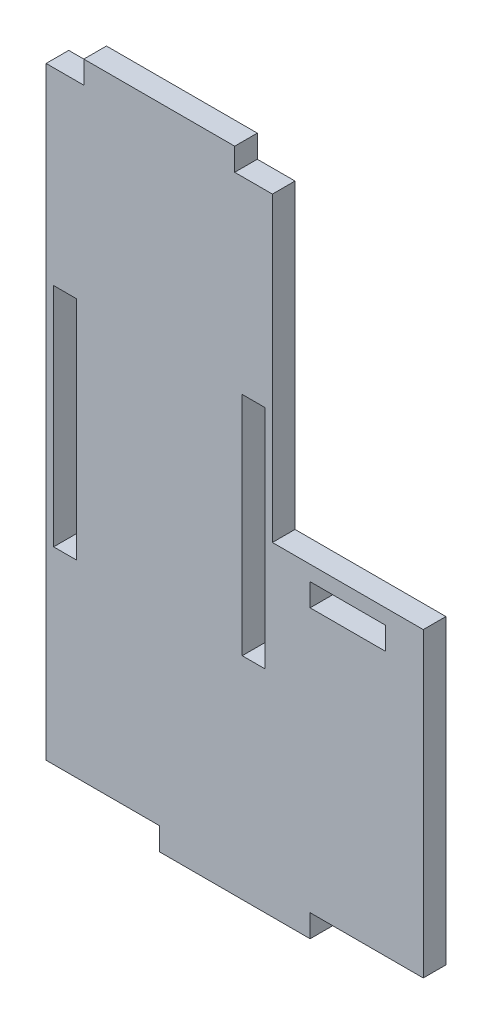
ISO-10303-21;
HEADER;
FILE_DESCRIPTION(('STEP AP214'),'2;1');
FILE_NAME('part.step','',(''),(''),'','','');
FILE_SCHEMA(('AUTOMOTIVE_DESIGN { 1 0 10303 214 1 1 1 1 }'));
ENDSEC;
DATA;
#1=APPLICATION_CONTEXT('core data for automotive mechanical design processes');
#2=APPLICATION_PROTOCOL_DEFINITION('international standard','automotive_design',2000,#1);
#3=PRODUCT_CONTEXT('',#1,'mechanical');
#4=PRODUCT('Part','Part','',(#3));
#5=PRODUCT_RELATED_PRODUCT_CATEGORY('part','',(#4));
#6=PRODUCT_DEFINITION_FORMATION('','',#4);
#7=PRODUCT_DEFINITION_CONTEXT('part definition',#1,'design');
#8=PRODUCT_DEFINITION('design','',#6,#7);
#9=PRODUCT_DEFINITION_SHAPE('','',#8);
#10=(LENGTH_UNIT() NAMED_UNIT(*) SI_UNIT(.MILLI.,.METRE.));
#11=(NAMED_UNIT(*) PLANE_ANGLE_UNIT() SI_UNIT($,.RADIAN.));
#12=(NAMED_UNIT(*) SI_UNIT($,.STERADIAN.) SOLID_ANGLE_UNIT());
#13=UNCERTAINTY_MEASURE_WITH_UNIT(LENGTH_MEASURE(1.E-05),#10,'distance_accuracy_value','');
#14=(GEOMETRIC_REPRESENTATION_CONTEXT(3) GLOBAL_UNCERTAINTY_ASSIGNED_CONTEXT((#13)) GLOBAL_UNIT_ASSIGNED_CONTEXT((#10,
#11,#12)) REPRESENTATION_CONTEXT('',''));
#15=CARTESIAN_POINT('',(0.,0.,0.));
#16=DIRECTION('',(0.,0.,1.));
#17=DIRECTION('',(1.,0.,0.));
#18=AXIS2_PLACEMENT_3D('',#15,#16,#17);
#19=CARTESIAN_POINT('',(0.,0.,1.5));
#20=DIRECTION('',(0.,0.,1.));
#21=DIRECTION('',(1.,0.,0.));
#22=AXIS2_PLACEMENT_3D('',#19,#20,#21);
#23=PLANE('',#22);
#24=DIRECTION('',(0.,-1.,0.));
#25=VECTOR('',#24,1.);
#26=CARTESIAN_POINT('',(-14.9999999999999,39.9999999999998,1.5));
#27=LINE('',#26,#25);
#28=CARTESIAN_POINT('',(-14.9999999999999,39.9999999999998,1.5));
#29=VERTEX_POINT('',#28);
#30=CARTESIAN_POINT('',(-14.9999999999999,-40.0000000000003,1.5));
#31=VERTEX_POINT('',#30);
#32=EDGE_CURVE('E303',#29,#31,#27,.T.);
#33=ORIENTED_EDGE('',*,*,#32,.T.);
#34=DIRECTION('',(1.,0.,0.));
#35=VECTOR('',#34,1.);
#36=CARTESIAN_POINT('',(-14.9999999999999,-40.0000000000003,1.5));
#37=LINE('',#36,#35);
#38=CARTESIAN_POINT('',(0.,-40.0000000000003,1.5));
#39=VERTEX_POINT('',#38);
#40=EDGE_CURVE('E306',#31,#39,#37,.T.);
#41=ORIENTED_EDGE('',*,*,#40,.T.);
#42=DIRECTION('',(0.,-1.,0.));
#43=VECTOR('',#42,1.);
#44=CARTESIAN_POINT('',(0.,-40.0000000000003,1.5));
#45=LINE('',#44,#43);
#46=CARTESIAN_POINT('',(0.,-43.0000000000003,1.5));
#47=VERTEX_POINT('',#46);
#48=EDGE_CURVE('E309',#39,#47,#45,.T.);
#49=ORIENTED_EDGE('',*,*,#48,.T.);
#50=DIRECTION('',(1.,0.,0.));
#51=VECTOR('',#50,1.);
#52=CARTESIAN_POINT('',(0.,-43.0000000000003,1.5));
#53=LINE('',#52,#51);
#54=CARTESIAN_POINT('',(20.0000000000001,-43.0000000000003,1.5));
#55=VERTEX_POINT('',#54);
#56=EDGE_CURVE('E311',#47,#55,#53,.T.);
#57=ORIENTED_EDGE('',*,*,#56,.T.);
#58=DIRECTION('',(0.,1.,0.));
#59=VECTOR('',#58,1.);
#60=CARTESIAN_POINT('',(20.0000000000001,-40.0000000000003,1.5));
#61=LINE('',#60,#59);
#62=CARTESIAN_POINT('',(20.0000000000001,-40.0000000000003,1.5));
#63=VERTEX_POINT('',#62);
#64=EDGE_CURVE('E313',#55,#63,#61,.T.);
#65=ORIENTED_EDGE('',*,*,#64,.T.);
#66=DIRECTION('',(1.,0.,0.));
#67=VECTOR('',#66,1.);
#68=CARTESIAN_POINT('',(20.0000000000001,-40.0000000000003,1.5));
#69=LINE('',#68,#67);
#70=CARTESIAN_POINT('',(35.0000000000001,-40.0000000000003,1.5));
#71=VERTEX_POINT('',#70);
#72=EDGE_CURVE('E315',#63,#71,#69,.T.);
#73=ORIENTED_EDGE('',*,*,#72,.T.);
#74=DIRECTION('',(0.,1.,0.));
#75=VECTOR('',#74,1.);
#76=CARTESIAN_POINT('',(35.0000000000001,-2.56739074444567E-13,1.5));
#77=LINE('',#76,#75);
#78=CARTESIAN_POINT('',(35.0000000000001,-2.56739074444567E-13,1.5));
#79=VERTEX_POINT('',#78);
#80=EDGE_CURVE('E317',#71,#79,#77,.T.);
#81=ORIENTED_EDGE('',*,*,#80,.T.);
#82=DIRECTION('',(-1.,0.,0.));
#83=VECTOR('',#82,1.);
#84=CARTESIAN_POINT('',(15.0000000000001,-2.22044604925031E-13,1.5));
#85=LINE('',#84,#83);
#86=CARTESIAN_POINT('',(15.0000000000001,-2.22044604925031E-13,1.5));
#87=VERTEX_POINT('',#86);
#88=EDGE_CURVE('E319',#79,#87,#85,.T.);
#89=ORIENTED_EDGE('',*,*,#88,.T.);
#90=DIRECTION('',(0.,1.,0.));
#91=VECTOR('',#90,1.);
#92=CARTESIAN_POINT('',(14.9999999999997,39.9999999999997,1.5));
#93=LINE('',#92,#91);
#94=CARTESIAN_POINT('',(14.9999999999997,39.9999999999997,1.5));
#95=VERTEX_POINT('',#94);
#96=EDGE_CURVE('E321',#87,#95,#93,.T.);
#97=ORIENTED_EDGE('',*,*,#96,.T.);
#98=DIRECTION('',(-1.,0.,0.));
#99=VECTOR('',#98,1.);
#100=CARTESIAN_POINT('',(10.0000000000001,39.9999999999997,1.5));
#101=LINE('',#100,#99);
#102=CARTESIAN_POINT('',(10.0000000000001,39.9999999999997,1.5));
#103=VERTEX_POINT('',#102);
#104=EDGE_CURVE('E323',#95,#103,#101,.T.);
#105=ORIENTED_EDGE('',*,*,#104,.T.);
#106=DIRECTION('',(0.,1.,0.));
#107=VECTOR('',#106,1.);
#108=CARTESIAN_POINT('',(10.0000000000001,39.9999999999997,1.5));
#109=LINE('',#108,#107);
#110=CARTESIAN_POINT('',(10.0000000000001,42.9999999999997,1.5));
#111=VERTEX_POINT('',#110);
#112=EDGE_CURVE('E325',#103,#111,#109,.T.);
#113=ORIENTED_EDGE('',*,*,#112,.T.);
#114=DIRECTION('',(-1.,0.,0.));
#115=VECTOR('',#114,1.);
#116=CARTESIAN_POINT('',(-9.99999999999993,42.9999999999997,1.5));
#117=LINE('',#116,#115);
#118=CARTESIAN_POINT('',(-9.99999999999993,42.9999999999997,1.5));
#119=VERTEX_POINT('',#118);
#120=EDGE_CURVE('E327',#111,#119,#117,.T.);
#121=ORIENTED_EDGE('',*,*,#120,.T.);
#122=DIRECTION('',(0.,-1.,0.));
#123=VECTOR('',#122,1.);
#124=CARTESIAN_POINT('',(-9.99999999999993,39.9999999999997,1.5));
#125=LINE('',#124,#123);
#126=CARTESIAN_POINT('',(-9.99999999999993,39.9999999999997,1.5));
#127=VERTEX_POINT('',#126);
#128=EDGE_CURVE('E329',#119,#127,#125,.T.);
#129=ORIENTED_EDGE('',*,*,#128,.T.);
#130=DIRECTION('',(-1.,0.,0.));
#131=VECTOR('',#130,1.);
#132=CARTESIAN_POINT('',(-14.9999999999999,39.9999999999998,1.5));
#133=LINE('',#132,#131);
#134=EDGE_CURVE('E331',#127,#29,#133,.T.);
#135=ORIENTED_EDGE('',*,*,#134,.T.);
#136=EDGE_LOOP('',(#33,#41,#49,#57,#65,#73,#81,#89,#97,#105,#113,#121,#129,#135));
#137=FACE_BOUND('',#136,.T.);
#138=DIRECTION('',(1.,0.,0.));
#139=VECTOR('',#138,1.);
#140=CARTESIAN_POINT('',(-13.9999999999999,-15.0000000000002,1.5));
#141=LINE('',#140,#139);
#142=CARTESIAN_POINT('',(-13.9999999999999,-15.0000000000002,1.5));
#143=VERTEX_POINT('',#142);
#144=CARTESIAN_POINT('',(-10.9999999999999,-15.0000000000002,1.5));
#145=VERTEX_POINT('',#144);
#146=EDGE_CURVE('E274',#143,#145,#141,.T.);
#147=ORIENTED_EDGE('',*,*,#146,.F.);
#148=DIRECTION('',(0.,-1.,0.));
#149=VECTOR('',#148,1.);
#150=CARTESIAN_POINT('',(-13.9999999999999,14.9999999999998,1.5));
#151=LINE('',#150,#149);
#152=CARTESIAN_POINT('',(-13.9999999999999,14.9999999999998,1.5));
#153=VERTEX_POINT('',#152);
#154=EDGE_CURVE('E272',#153,#143,#151,.T.);
#155=ORIENTED_EDGE('',*,*,#154,.F.);
#156=DIRECTION('',(-1.,0.,0.));
#157=VECTOR('',#156,1.);
#158=CARTESIAN_POINT('',(-13.9999999999999,14.9999999999998,1.5));
#159=LINE('',#158,#157);
#160=CARTESIAN_POINT('',(-10.9999999999999,14.9999999999998,1.5));
#161=VERTEX_POINT('',#160);
#162=EDGE_CURVE('E280',#161,#153,#159,.T.);
#163=ORIENTED_EDGE('',*,*,#162,.F.);
#164=DIRECTION('',(0.,1.,0.));
#165=VECTOR('',#164,1.);
#166=CARTESIAN_POINT('',(-10.9999999999999,14.9999999999998,1.5));
#167=LINE('',#166,#165);
#168=EDGE_CURVE('E277',#145,#161,#167,.T.);
#169=ORIENTED_EDGE('',*,*,#168,.F.);
#170=EDGE_LOOP('',(#147,#155,#163,#169));
#171=FACE_BOUND('',#170,.T.);
#172=DIRECTION('',(1.,0.,0.));
#173=VECTOR('',#172,1.);
#174=CARTESIAN_POINT('',(10.9999999999998,-15.0000000000002,1.5));
#175=LINE('',#174,#173);
#176=CARTESIAN_POINT('',(10.9999999999998,-15.0000000000002,1.5));
#177=VERTEX_POINT('',#176);
#178=CARTESIAN_POINT('',(13.9999999999998,-15.0000000000002,1.5));
#179=VERTEX_POINT('',#178);
#180=EDGE_CURVE('E243',#177,#179,#175,.T.);
#181=ORIENTED_EDGE('',*,*,#180,.F.);
#182=DIRECTION('',(0.,-1.,0.));
#183=VECTOR('',#182,1.);
#184=CARTESIAN_POINT('',(10.9999999999998,14.9999999999998,1.5));
#185=LINE('',#184,#183);
#186=CARTESIAN_POINT('',(10.9999999999998,14.9999999999998,1.5));
#187=VERTEX_POINT('',#186);
#188=EDGE_CURVE('E241',#187,#177,#185,.T.);
#189=ORIENTED_EDGE('',*,*,#188,.F.);
#190=DIRECTION('',(-1.,0.,0.));
#191=VECTOR('',#190,1.);
#192=CARTESIAN_POINT('',(10.9999999999998,14.9999999999998,1.5));
#193=LINE('',#192,#191);
#194=CARTESIAN_POINT('',(13.9999999999998,14.9999999999998,1.5));
#195=VERTEX_POINT('',#194);
#196=EDGE_CURVE('E249',#195,#187,#193,.T.);
#197=ORIENTED_EDGE('',*,*,#196,.F.);
#198=DIRECTION('',(0.,1.,0.));
#199=VECTOR('',#198,1.);
#200=CARTESIAN_POINT('',(13.9999999999998,14.9999999999998,1.5));
#201=LINE('',#200,#199);
#202=EDGE_CURVE('E246',#179,#195,#201,.T.);
#203=ORIENTED_EDGE('',*,*,#202,.F.);
#204=EDGE_LOOP('',(#181,#189,#197,#203));
#205=FACE_BOUND('',#204,.T.);
#206=DIRECTION('',(1.,0.,0.));
#207=VECTOR('',#206,1.);
#208=CARTESIAN_POINT('',(20.0000000000001,-5.00000000000025,1.5));
#209=LINE('',#208,#207);
#210=CARTESIAN_POINT('',(20.0000000000001,-5.00000000000025,1.5));
#211=VERTEX_POINT('',#210);
#212=CARTESIAN_POINT('',(30.0000000000001,-5.00000000000025,1.5));
#213=VERTEX_POINT('',#212);
#214=EDGE_CURVE('E213',#211,#213,#209,.T.);
#215=ORIENTED_EDGE('',*,*,#214,.F.);
#216=DIRECTION('',(0.,-1.,0.));
#217=VECTOR('',#216,1.);
#218=CARTESIAN_POINT('',(20.0000000000001,-2.00000000000025,1.5));
#219=LINE('',#218,#217);
#220=CARTESIAN_POINT('',(20.0000000000001,-2.00000000000025,1.5));
#221=VERTEX_POINT('',#220);
#222=EDGE_CURVE('E205',#221,#211,#219,.T.);
#223=ORIENTED_EDGE('',*,*,#222,.F.);
#224=DIRECTION('',(-1.,0.,0.));
#225=VECTOR('',#224,1.);
#226=CARTESIAN_POINT('',(20.0000000000001,-2.00000000000025,1.5));
#227=LINE('',#226,#225);
#228=CARTESIAN_POINT('',(30.0000000000001,-2.00000000000025,1.5));
#229=VERTEX_POINT('',#228);
#230=EDGE_CURVE('E227',#229,#221,#227,.T.);
#231=ORIENTED_EDGE('',*,*,#230,.F.);
#232=DIRECTION('',(0.,1.,0.));
#233=VECTOR('',#232,1.);
#234=CARTESIAN_POINT('',(30.0000000000001,-2.00000000000025,1.5));
#235=LINE('',#234,#233);
#236=EDGE_CURVE('E225',#213,#229,#235,.T.);
#237=ORIENTED_EDGE('',*,*,#236,.F.);
#238=EDGE_LOOP('',(#215,#223,#231,#237));
#239=FACE_BOUND('',#238,.T.);
#240=ADVANCED_FACE('F32',(#137,#171,#205,#239),#23,.T.);
#241=CARTESIAN_POINT('',(0.,0.,-1.5));
#242=DIRECTION('',(0.,0.,1.));
#243=DIRECTION('',(1.,0.,0.));
#244=AXIS2_PLACEMENT_3D('',#241,#242,#243);
#245=PLANE('',#244);
#246=DIRECTION('',(0.,-1.,0.));
#247=VECTOR('',#246,1.);
#248=CARTESIAN_POINT('',(10.9999999999998,14.9999999999998,-1.5));
#249=LINE('',#248,#247);
#250=CARTESIAN_POINT('',(10.9999999999998,14.9999999999998,-1.5));
#251=VERTEX_POINT('',#250);
#252=CARTESIAN_POINT('',(10.9999999999998,-15.0000000000002,-1.5));
#253=VERTEX_POINT('',#252);
#254=EDGE_CURVE('E221',#251,#253,#249,.T.);
#255=ORIENTED_EDGE('',*,*,#254,.T.);
#256=DIRECTION('',(1.,0.,0.));
#257=VECTOR('',#256,1.);
#258=CARTESIAN_POINT('',(10.9999999999998,-15.0000000000002,-1.5));
#259=LINE('',#258,#257);
#260=CARTESIAN_POINT('',(13.9999999999998,-15.0000000000002,-1.5));
#261=VERTEX_POINT('',#260);
#262=EDGE_CURVE('E254',#253,#261,#259,.T.);
#263=ORIENTED_EDGE('',*,*,#262,.T.);
#264=DIRECTION('',(0.,1.,0.));
#265=VECTOR('',#264,1.);
#266=CARTESIAN_POINT('',(13.9999999999998,14.9999999999998,-1.5));
#267=LINE('',#266,#265);
#268=CARTESIAN_POINT('',(13.9999999999998,14.9999999999998,-1.5));
#269=VERTEX_POINT('',#268);
#270=EDGE_CURVE('E257',#261,#269,#267,.T.);
#271=ORIENTED_EDGE('',*,*,#270,.T.);
#272=DIRECTION('',(-1.,0.,0.));
#273=VECTOR('',#272,1.);
#274=CARTESIAN_POINT('',(10.9999999999998,14.9999999999998,-1.5));
#275=LINE('',#274,#273);
#276=EDGE_CURVE('E244',#269,#251,#275,.T.);
#277=ORIENTED_EDGE('',*,*,#276,.T.);
#278=EDGE_LOOP('',(#255,#263,#271,#277));
#279=FACE_BOUND('',#278,.T.);
#280=DIRECTION('',(0.,-1.,0.));
#281=VECTOR('',#280,1.);
#282=CARTESIAN_POINT('',(-14.9999999999999,39.9999999999998,-1.5));
#283=LINE('',#282,#281);
#284=CARTESIAN_POINT('',(-14.9999999999999,39.9999999999998,-1.5));
#285=VERTEX_POINT('',#284);
#286=CARTESIAN_POINT('',(-14.9999999999999,-40.0000000000003,-1.5));
#287=VERTEX_POINT('',#286);
#288=EDGE_CURVE('E302',#285,#287,#283,.T.);
#289=ORIENTED_EDGE('',*,*,#288,.F.);
#290=DIRECTION('',(-1.,0.,0.));
#291=VECTOR('',#290,1.);
#292=CARTESIAN_POINT('',(-14.9999999999999,39.9999999999998,-1.5));
#293=LINE('',#292,#291);
#294=CARTESIAN_POINT('',(-9.99999999999993,39.9999999999997,-1.5));
#295=VERTEX_POINT('',#294);
#296=EDGE_CURVE('E307',#295,#285,#293,.T.);
#297=ORIENTED_EDGE('',*,*,#296,.F.);
#298=DIRECTION('',(0.,-1.,0.));
#299=VECTOR('',#298,1.);
#300=CARTESIAN_POINT('',(-9.99999999999993,39.9999999999997,-1.5));
#301=LINE('',#300,#299);
#302=CARTESIAN_POINT('',(-9.99999999999993,42.9999999999997,-1.5));
#303=VERTEX_POINT('',#302);
#304=EDGE_CURVE('E358',#303,#295,#301,.T.);
#305=ORIENTED_EDGE('',*,*,#304,.F.);
#306=DIRECTION('',(-1.,0.,0.));
#307=VECTOR('',#306,1.);
#308=CARTESIAN_POINT('',(-9.99999999999993,42.9999999999997,-1.5));
#309=LINE('',#308,#307);
#310=CARTESIAN_POINT('',(10.0000000000001,42.9999999999997,-1.5));
#311=VERTEX_POINT('',#310);
#312=EDGE_CURVE('E356',#311,#303,#309,.T.);
#313=ORIENTED_EDGE('',*,*,#312,.F.);
#314=DIRECTION('',(0.,1.,0.));
#315=VECTOR('',#314,1.);
#316=CARTESIAN_POINT('',(10.0000000000001,39.9999999999997,-1.5));
#317=LINE('',#316,#315);
#318=CARTESIAN_POINT('',(10.0000000000001,39.9999999999997,-1.5));
#319=VERTEX_POINT('',#318);
#320=EDGE_CURVE('E354',#319,#311,#317,.T.);
#321=ORIENTED_EDGE('',*,*,#320,.F.);
#322=DIRECTION('',(-1.,0.,0.));
#323=VECTOR('',#322,1.);
#324=CARTESIAN_POINT('',(10.0000000000001,39.9999999999997,-1.5));
#325=LINE('',#324,#323);
#326=CARTESIAN_POINT('',(14.9999999999997,39.9999999999997,-1.5));
#327=VERTEX_POINT('',#326);
#328=EDGE_CURVE('E352',#327,#319,#325,.T.);
#329=ORIENTED_EDGE('',*,*,#328,.F.);
#330=DIRECTION('',(0.,1.,0.));
#331=VECTOR('',#330,1.);
#332=CARTESIAN_POINT('',(14.9999999999997,39.9999999999997,-1.5));
#333=LINE('',#332,#331);
#334=CARTESIAN_POINT('',(15.0000000000001,-2.22044604925031E-13,-1.5));
#335=VERTEX_POINT('',#334);
#336=EDGE_CURVE('E350',#335,#327,#333,.T.);
#337=ORIENTED_EDGE('',*,*,#336,.F.);
#338=DIRECTION('',(-1.,0.,0.));
#339=VECTOR('',#338,1.);
#340=CARTESIAN_POINT('',(15.0000000000001,-2.22044604925031E-13,-1.5));
#341=LINE('',#340,#339);
#342=CARTESIAN_POINT('',(35.0000000000001,-2.56739074444567E-13,-1.5));
#343=VERTEX_POINT('',#342);
#344=EDGE_CURVE('E348',#343,#335,#341,.T.);
#345=ORIENTED_EDGE('',*,*,#344,.F.);
#346=DIRECTION('',(0.,1.,0.));
#347=VECTOR('',#346,1.);
#348=CARTESIAN_POINT('',(35.0000000000001,-2.56739074444567E-13,-1.5));
#349=LINE('',#348,#347);
#350=CARTESIAN_POINT('',(35.0000000000001,-40.0000000000003,-1.5));
#351=VERTEX_POINT('',#350);
#352=EDGE_CURVE('E346',#351,#343,#349,.T.);
#353=ORIENTED_EDGE('',*,*,#352,.F.);
#354=DIRECTION('',(1.,0.,0.));
#355=VECTOR('',#354,1.);
#356=CARTESIAN_POINT('',(20.0000000000001,-40.0000000000003,-1.5));
#357=LINE('',#356,#355);
#358=CARTESIAN_POINT('',(20.0000000000001,-40.0000000000003,-1.5));
#359=VERTEX_POINT('',#358);
#360=EDGE_CURVE('E344',#359,#351,#357,.T.);
#361=ORIENTED_EDGE('',*,*,#360,.F.);
#362=DIRECTION('',(0.,1.,0.));
#363=VECTOR('',#362,1.);
#364=CARTESIAN_POINT('',(20.0000000000001,-40.0000000000003,-1.5));
#365=LINE('',#364,#363);
#366=CARTESIAN_POINT('',(20.0000000000001,-43.0000000000003,-1.5));
#367=VERTEX_POINT('',#366);
#368=EDGE_CURVE('E342',#367,#359,#365,.T.);
#369=ORIENTED_EDGE('',*,*,#368,.F.);
#370=DIRECTION('',(1.,0.,0.));
#371=VECTOR('',#370,1.);
#372=CARTESIAN_POINT('',(0.,-43.0000000000003,-1.5));
#373=LINE('',#372,#371);
#374=CARTESIAN_POINT('',(0.,-43.0000000000003,-1.5));
#375=VERTEX_POINT('',#374);
#376=EDGE_CURVE('E340',#375,#367,#373,.T.);
#377=ORIENTED_EDGE('',*,*,#376,.F.);
#378=DIRECTION('',(0.,-1.,0.));
#379=VECTOR('',#378,1.);
#380=CARTESIAN_POINT('',(0.,-40.0000000000003,-1.5));
#381=LINE('',#380,#379);
#382=CARTESIAN_POINT('',(0.,-40.0000000000003,-1.5));
#383=VERTEX_POINT('',#382);
#384=EDGE_CURVE('E338',#383,#375,#381,.T.);
#385=ORIENTED_EDGE('',*,*,#384,.F.);
#386=DIRECTION('',(1.,0.,0.));
#387=VECTOR('',#386,1.);
#388=CARTESIAN_POINT('',(-14.9999999999999,-40.0000000000003,-1.5));
#389=LINE('',#388,#387);
#390=EDGE_CURVE('E336',#287,#383,#389,.T.);
#391=ORIENTED_EDGE('',*,*,#390,.F.);
#392=EDGE_LOOP('',(#289,#297,#305,#313,#321,#329,#337,#345,#353,#361,#369,#377,#385,#391));
#393=FACE_BOUND('',#392,.T.);
#394=DIRECTION('',(0.,-1.,0.));
#395=VECTOR('',#394,1.);
#396=CARTESIAN_POINT('',(-13.9999999999999,14.9999999999998,-1.5));
#397=LINE('',#396,#395);
#398=CARTESIAN_POINT('',(-13.9999999999999,14.9999999999998,-1.5));
#399=VERTEX_POINT('',#398);
#400=CARTESIAN_POINT('',(-13.9999999999999,-15.0000000000002,-1.5));
#401=VERTEX_POINT('',#400);
#402=EDGE_CURVE('E271',#399,#401,#397,.T.);
#403=ORIENTED_EDGE('',*,*,#402,.T.);
#404=DIRECTION('',(1.,0.,0.));
#405=VECTOR('',#404,1.);
#406=CARTESIAN_POINT('',(-13.9999999999999,-15.0000000000002,-1.5));
#407=LINE('',#406,#405);
#408=CARTESIAN_POINT('',(-10.9999999999999,-15.0000000000002,-1.5));
#409=VERTEX_POINT('',#408);
#410=EDGE_CURVE('E285',#401,#409,#407,.T.);
#411=ORIENTED_EDGE('',*,*,#410,.T.);
#412=DIRECTION('',(0.,1.,0.));
#413=VECTOR('',#412,1.);
#414=CARTESIAN_POINT('',(-10.9999999999999,14.9999999999998,-1.5));
#415=LINE('',#414,#413);
#416=CARTESIAN_POINT('',(-10.9999999999999,14.9999999999998,-1.5));
#417=VERTEX_POINT('',#416);
#418=EDGE_CURVE('E288',#409,#417,#415,.T.);
#419=ORIENTED_EDGE('',*,*,#418,.T.);
#420=DIRECTION('',(-1.,0.,0.));
#421=VECTOR('',#420,1.);
#422=CARTESIAN_POINT('',(-13.9999999999999,14.9999999999998,-1.5));
#423=LINE('',#422,#421);
#424=EDGE_CURVE('E275',#417,#399,#423,.T.);
#425=ORIENTED_EDGE('',*,*,#424,.T.);
#426=EDGE_LOOP('',(#403,#411,#419,#425));
#427=FACE_BOUND('',#426,.T.);
#428=DIRECTION('',(0.,-1.,0.));
#429=VECTOR('',#428,1.);
#430=CARTESIAN_POINT('',(20.0000000000001,-2.00000000000025,-1.5));
#431=LINE('',#430,#429);
#432=CARTESIAN_POINT('',(20.0000000000001,-2.00000000000025,-1.5));
#433=VERTEX_POINT('',#432);
#434=CARTESIAN_POINT('',(20.0000000000001,-5.00000000000025,-1.5));
#435=VERTEX_POINT('',#434);
#436=EDGE_CURVE('E55',#433,#435,#431,.T.);
#437=ORIENTED_EDGE('',*,*,#436,.T.);
#438=DIRECTION('',(1.,0.,0.));
#439=VECTOR('',#438,1.);
#440=CARTESIAN_POINT('',(20.0000000000001,-5.00000000000025,-1.5));
#441=LINE('',#440,#439);
#442=CARTESIAN_POINT('',(30.0000000000001,-5.00000000000025,-1.5));
#443=VERTEX_POINT('',#442);
#444=EDGE_CURVE('E220',#435,#443,#441,.T.);
#445=ORIENTED_EDGE('',*,*,#444,.T.);
#446=DIRECTION('',(0.,1.,0.));
#447=VECTOR('',#446,1.);
#448=CARTESIAN_POINT('',(30.0000000000001,-2.00000000000025,-1.5));
#449=LINE('',#448,#447);
#450=CARTESIAN_POINT('',(30.0000000000001,-2.00000000000025,-1.5));
#451=VERTEX_POINT('',#450);
#452=EDGE_CURVE('E233',#443,#451,#449,.T.);
#453=ORIENTED_EDGE('',*,*,#452,.T.);
#454=DIRECTION('',(-1.,0.,0.));
#455=VECTOR('',#454,1.);
#456=CARTESIAN_POINT('',(20.0000000000001,-2.00000000000025,-1.5));
#457=LINE('',#456,#455);
#458=EDGE_CURVE('E214',#451,#433,#457,.T.);
#459=ORIENTED_EDGE('',*,*,#458,.T.);
#460=EDGE_LOOP('',(#437,#445,#453,#459));
#461=FACE_BOUND('',#460,.T.);
#462=ADVANCED_FACE('F406',(#279,#393,#427,#461),#245,.F.);
#463=CARTESIAN_POINT('',(-14.9999999999999,39.9999999999998,1.5));
#464=DIRECTION('',(1.,0.,0.));
#465=DIRECTION('',(0.,1.,0.));
#466=AXIS2_PLACEMENT_3D('',#463,#464,#465);
#467=PLANE('',#466);
#468=ORIENTED_EDGE('',*,*,#288,.T.);
#469=DIRECTION('',(0.,0.,-1.));
#470=VECTOR('',#469,1.);
#471=CARTESIAN_POINT('',(-14.9999999999999,-40.0000000000003,1.5));
#472=LINE('',#471,#470);
#473=EDGE_CURVE('E11',#31,#287,#472,.T.);
#474=ORIENTED_EDGE('',*,*,#473,.F.);
#475=ORIENTED_EDGE('',*,*,#32,.F.);
#476=DIRECTION('',(0.,0.,-1.));
#477=VECTOR('',#476,1.);
#478=CARTESIAN_POINT('',(-14.9999999999999,39.9999999999998,1.5));
#479=LINE('',#478,#477);
#480=EDGE_CURVE('E333',#29,#285,#479,.T.);
#481=ORIENTED_EDGE('',*,*,#480,.T.);
#482=EDGE_LOOP('',(#468,#474,#475,#481));
#483=FACE_BOUND('',#482,.T.);
#484=ADVANCED_FACE('F34',(#483),#467,.F.);
#485=CARTESIAN_POINT('',(-14.9999999999999,-40.0000000000003,1.5));
#486=DIRECTION('',(0.,1.,0.));
#487=DIRECTION('',(0.,0.,1.));
#488=AXIS2_PLACEMENT_3D('',#485,#486,#487);
#489=PLANE('',#488);
#490=ORIENTED_EDGE('',*,*,#390,.T.);
#491=DIRECTION('',(0.,0.,-1.));
#492=VECTOR('',#491,1.);
#493=CARTESIAN_POINT('',(0.,-40.0000000000003,1.5));
#494=LINE('',#493,#492);
#495=EDGE_CURVE('E40',#39,#383,#494,.T.);
#496=ORIENTED_EDGE('',*,*,#495,.F.);
#497=ORIENTED_EDGE('',*,*,#40,.F.);
#498=ORIENTED_EDGE('',*,*,#473,.T.);
#499=EDGE_LOOP('',(#490,#496,#497,#498));
#500=FACE_BOUND('',#499,.T.);
#501=ADVANCED_FACE('F424',(#500),#489,.F.);
#502=CARTESIAN_POINT('',(0.,-40.0000000000003,1.5));
#503=DIRECTION('',(1.,0.,0.));
#504=DIRECTION('',(0.,1.,0.));
#505=AXIS2_PLACEMENT_3D('',#502,#503,#504);
#506=PLANE('',#505);
#507=ORIENTED_EDGE('',*,*,#384,.T.);
#508=DIRECTION('',(0.,0.,-1.));
#509=VECTOR('',#508,1.);
#510=CARTESIAN_POINT('',(0.,-43.0000000000003,1.5));
#511=LINE('',#510,#509);
#512=EDGE_CURVE('E393',#47,#375,#511,.T.);
#513=ORIENTED_EDGE('',*,*,#512,.F.);
#514=ORIENTED_EDGE('',*,*,#48,.F.);
#515=ORIENTED_EDGE('',*,*,#495,.T.);
#516=EDGE_LOOP('',(#507,#513,#514,#515));
#517=FACE_BOUND('',#516,.T.);
#518=ADVANCED_FACE('F400',(#517),#506,.F.);
#519=CARTESIAN_POINT('',(0.,-43.0000000000003,1.5));
#520=DIRECTION('',(0.,1.,0.));
#521=DIRECTION('',(0.,0.,1.));
#522=AXIS2_PLACEMENT_3D('',#519,#520,#521);
#523=PLANE('',#522);
#524=ORIENTED_EDGE('',*,*,#376,.T.);
#525=DIRECTION('',(0.,0.,-1.));
#526=VECTOR('',#525,1.);
#527=CARTESIAN_POINT('',(20.0000000000001,-43.0000000000003,1.5));
#528=LINE('',#527,#526);
#529=EDGE_CURVE('E390',#55,#367,#528,.T.);
#530=ORIENTED_EDGE('',*,*,#529,.F.);
#531=ORIENTED_EDGE('',*,*,#56,.F.);
#532=ORIENTED_EDGE('',*,*,#512,.T.);
#533=EDGE_LOOP('',(#524,#530,#531,#532));
#534=FACE_BOUND('',#533,.T.);
#535=ADVANCED_FACE('F412',(#534),#523,.F.);
#536=CARTESIAN_POINT('',(20.0000000000001,-40.0000000000003,1.5));
#537=DIRECTION('',(-1.,0.,0.));
#538=DIRECTION('',(0.,0.,1.));
#539=AXIS2_PLACEMENT_3D('',#536,#537,#538);
#540=PLANE('',#539);
#541=ORIENTED_EDGE('',*,*,#368,.T.);
#542=DIRECTION('',(0.,0.,-1.));
#543=VECTOR('',#542,1.);
#544=CARTESIAN_POINT('',(20.0000000000001,-40.0000000000003,1.5));
#545=LINE('',#544,#543);
#546=EDGE_CURVE('E387',#63,#359,#545,.T.);
#547=ORIENTED_EDGE('',*,*,#546,.F.);
#548=ORIENTED_EDGE('',*,*,#64,.F.);
#549=ORIENTED_EDGE('',*,*,#529,.T.);
#550=EDGE_LOOP('',(#541,#547,#548,#549));
#551=FACE_BOUND('',#550,.T.);
#552=ADVANCED_FACE('F416',(#551),#540,.F.);
#553=CARTESIAN_POINT('',(20.0000000000001,-40.0000000000003,1.5));
#554=DIRECTION('',(0.,1.,0.));
#555=DIRECTION('',(0.,0.,1.));
#556=AXIS2_PLACEMENT_3D('',#553,#554,#555);
#557=PLANE('',#556);
#558=ORIENTED_EDGE('',*,*,#360,.T.);
#559=DIRECTION('',(0.,0.,-1.));
#560=VECTOR('',#559,1.);
#561=CARTESIAN_POINT('',(35.0000000000001,-40.0000000000003,1.5));
#562=LINE('',#561,#560);
#563=EDGE_CURVE('E384',#71,#351,#562,.T.);
#564=ORIENTED_EDGE('',*,*,#563,.F.);
#565=ORIENTED_EDGE('',*,*,#72,.F.);
#566=ORIENTED_EDGE('',*,*,#546,.T.);
#567=EDGE_LOOP('',(#558,#564,#565,#566));
#568=FACE_BOUND('',#567,.T.);
#569=ADVANCED_FACE('F467',(#568),#557,.F.);
#570=CARTESIAN_POINT('',(35.0000000000001,-2.56739074444567E-13,1.5));
#571=DIRECTION('',(-1.,0.,0.));
#572=DIRECTION('',(0.,0.,1.));
#573=AXIS2_PLACEMENT_3D('',#570,#571,#572);
#574=PLANE('',#573);
#575=ORIENTED_EDGE('',*,*,#352,.T.);
#576=DIRECTION('',(0.,0.,-1.));
#577=VECTOR('',#576,1.);
#578=CARTESIAN_POINT('',(35.0000000000001,-2.56739074444567E-13,1.5));
#579=LINE('',#578,#577);
#580=EDGE_CURVE('E381',#79,#343,#579,.T.);
#581=ORIENTED_EDGE('',*,*,#580,.F.);
#582=ORIENTED_EDGE('',*,*,#80,.F.);
#583=ORIENTED_EDGE('',*,*,#563,.T.);
#584=EDGE_LOOP('',(#575,#581,#582,#583));
#585=FACE_BOUND('',#584,.T.);
#586=ADVANCED_FACE('F465',(#585),#574,.F.);
#587=CARTESIAN_POINT('',(15.0000000000001,-2.22044604925031E-13,1.5));
#588=DIRECTION('',(0.,-1.,0.));
#589=DIRECTION('',(1.,0.,0.));
#590=AXIS2_PLACEMENT_3D('',#587,#588,#589);
#591=PLANE('',#590);
#592=ORIENTED_EDGE('',*,*,#344,.T.);
#593=DIRECTION('',(0.,0.,-1.));
#594=VECTOR('',#593,1.);
#595=CARTESIAN_POINT('',(15.0000000000001,-2.22044604925031E-13,1.5));
#596=LINE('',#595,#594);
#597=EDGE_CURVE('E378',#87,#335,#596,.T.);
#598=ORIENTED_EDGE('',*,*,#597,.F.);
#599=ORIENTED_EDGE('',*,*,#88,.F.);
#600=ORIENTED_EDGE('',*,*,#580,.T.);
#601=EDGE_LOOP('',(#592,#598,#599,#600));
#602=FACE_BOUND('',#601,.T.);
#603=ADVANCED_FACE('F460',(#602),#591,.F.);
#604=CARTESIAN_POINT('',(14.9999999999997,39.9999999999997,1.5));
#605=DIRECTION('',(-1.,0.,0.));
#606=DIRECTION('',(0.,-1.,0.));
#607=AXIS2_PLACEMENT_3D('',#604,#605,#606);
#608=PLANE('',#607);
#609=ORIENTED_EDGE('',*,*,#336,.T.);
#610=DIRECTION('',(0.,0.,-1.));
#611=VECTOR('',#610,1.);
#612=CARTESIAN_POINT('',(14.9999999999997,39.9999999999997,1.5));
#613=LINE('',#612,#611);
#614=EDGE_CURVE('E375',#95,#327,#613,.T.);
#615=ORIENTED_EDGE('',*,*,#614,.F.);
#616=ORIENTED_EDGE('',*,*,#96,.F.);
#617=ORIENTED_EDGE('',*,*,#597,.T.);
#618=EDGE_LOOP('',(#609,#615,#616,#617));
#619=FACE_BOUND('',#618,.T.);
#620=ADVANCED_FACE('F455',(#619),#608,.F.);
#621=CARTESIAN_POINT('',(10.0000000000001,39.9999999999997,1.5));
#622=DIRECTION('',(0.,-1.,0.));
#623=DIRECTION('',(0.,0.,-1.));
#624=AXIS2_PLACEMENT_3D('',#621,#622,#623);
#625=PLANE('',#624);
#626=ORIENTED_EDGE('',*,*,#328,.T.);
#627=DIRECTION('',(0.,0.,-1.));
#628=VECTOR('',#627,1.);
#629=CARTESIAN_POINT('',(10.0000000000001,39.9999999999997,1.5));
#630=LINE('',#629,#628);
#631=EDGE_CURVE('E372',#103,#319,#630,.T.);
#632=ORIENTED_EDGE('',*,*,#631,.F.);
#633=ORIENTED_EDGE('',*,*,#104,.F.);
#634=ORIENTED_EDGE('',*,*,#614,.T.);
#635=EDGE_LOOP('',(#626,#632,#633,#634));
#636=FACE_BOUND('',#635,.T.);
#637=ADVANCED_FACE('F451',(#636),#625,.F.);
#638=CARTESIAN_POINT('',(10.0000000000001,39.9999999999997,1.5));
#639=DIRECTION('',(-1.,0.,0.));
#640=DIRECTION('',(0.,0.,1.));
#641=AXIS2_PLACEMENT_3D('',#638,#639,#640);
#642=PLANE('',#641);
#643=ORIENTED_EDGE('',*,*,#320,.T.);
#644=DIRECTION('',(0.,0.,-1.));
#645=VECTOR('',#644,1.);
#646=CARTESIAN_POINT('',(10.0000000000001,42.9999999999997,1.5));
#647=LINE('',#646,#645);
#648=EDGE_CURVE('E369',#111,#311,#647,.T.);
#649=ORIENTED_EDGE('',*,*,#648,.F.);
#650=ORIENTED_EDGE('',*,*,#112,.F.);
#651=ORIENTED_EDGE('',*,*,#631,.T.);
#652=EDGE_LOOP('',(#643,#649,#650,#651));
#653=FACE_BOUND('',#652,.T.);
#654=ADVANCED_FACE('F446',(#653),#642,.F.);
#655=CARTESIAN_POINT('',(-9.99999999999993,42.9999999999997,1.5));
#656=DIRECTION('',(0.,-1.,0.));
#657=DIRECTION('',(0.,0.,-1.));
#658=AXIS2_PLACEMENT_3D('',#655,#656,#657);
#659=PLANE('',#658);
#660=ORIENTED_EDGE('',*,*,#312,.T.);
#661=DIRECTION('',(0.,0.,-1.));
#662=VECTOR('',#661,1.);
#663=CARTESIAN_POINT('',(-9.99999999999993,42.9999999999997,1.5));
#664=LINE('',#663,#662);
#665=EDGE_CURVE('E366',#119,#303,#664,.T.);
#666=ORIENTED_EDGE('',*,*,#665,.F.);
#667=ORIENTED_EDGE('',*,*,#120,.F.);
#668=ORIENTED_EDGE('',*,*,#648,.T.);
#669=EDGE_LOOP('',(#660,#666,#667,#668));
#670=FACE_BOUND('',#669,.T.);
#671=ADVANCED_FACE('F440',(#670),#659,.F.);
#672=CARTESIAN_POINT('',(-9.99999999999993,39.9999999999997,1.5));
#673=DIRECTION('',(1.,0.,0.));
#674=DIRECTION('',(0.,0.,-1.));
#675=AXIS2_PLACEMENT_3D('',#672,#673,#674);
#676=PLANE('',#675);
#677=ORIENTED_EDGE('',*,*,#304,.T.);
#678=DIRECTION('',(0.,0.,-1.));
#679=VECTOR('',#678,1.);
#680=CARTESIAN_POINT('',(-9.99999999999993,39.9999999999997,1.5));
#681=LINE('',#680,#679);
#682=EDGE_CURVE('E363',#127,#295,#681,.T.);
#683=ORIENTED_EDGE('',*,*,#682,.F.);
#684=ORIENTED_EDGE('',*,*,#128,.F.);
#685=ORIENTED_EDGE('',*,*,#665,.T.);
#686=EDGE_LOOP('',(#677,#683,#684,#685));
#687=FACE_BOUND('',#686,.T.);
#688=ADVANCED_FACE('F436',(#687),#676,.F.);
#689=CARTESIAN_POINT('',(-14.9999999999999,39.9999999999998,1.5));
#690=DIRECTION('',(0.,-1.,0.));
#691=DIRECTION('',(1.,0.,0.));
#692=AXIS2_PLACEMENT_3D('',#689,#690,#691);
#693=PLANE('',#692);
#694=ORIENTED_EDGE('',*,*,#296,.T.);
#695=ORIENTED_EDGE('',*,*,#480,.F.);
#696=ORIENTED_EDGE('',*,*,#134,.F.);
#697=ORIENTED_EDGE('',*,*,#682,.T.);
#698=EDGE_LOOP('',(#694,#695,#696,#697));
#699=FACE_BOUND('',#698,.T.);
#700=ADVANCED_FACE('F431',(#699),#693,.F.);
#701=CARTESIAN_POINT('',(-13.9999999999999,14.9999999999998,1.5));
#702=DIRECTION('',(1.,0.,0.));
#703=DIRECTION('',(0.,1.,0.));
#704=AXIS2_PLACEMENT_3D('',#701,#702,#703);
#705=PLANE('',#704);
#706=ORIENTED_EDGE('',*,*,#402,.F.);
#707=DIRECTION('',(0.,0.,-1.));
#708=VECTOR('',#707,1.);
#709=CARTESIAN_POINT('',(-13.9999999999999,14.9999999999998,1.5));
#710=LINE('',#709,#708);
#711=EDGE_CURVE('E282',#153,#399,#710,.T.);
#712=ORIENTED_EDGE('',*,*,#711,.F.);
#713=ORIENTED_EDGE('',*,*,#154,.T.);
#714=DIRECTION('',(0.,0.,-1.));
#715=VECTOR('',#714,1.);
#716=CARTESIAN_POINT('',(-13.9999999999999,-15.0000000000002,1.5));
#717=LINE('',#716,#715);
#718=EDGE_CURVE('E299',#143,#401,#717,.T.);
#719=ORIENTED_EDGE('',*,*,#718,.T.);
#720=EDGE_LOOP('',(#706,#712,#713,#719));
#721=FACE_BOUND('',#720,.T.);
#722=ADVANCED_FACE('F484',(#721),#705,.T.);
#723=CARTESIAN_POINT('',(-13.9999999999999,-15.0000000000002,1.5));
#724=DIRECTION('',(0.,1.,0.));
#725=DIRECTION('',(-1.,0.,0.));
#726=AXIS2_PLACEMENT_3D('',#723,#724,#725);
#727=PLANE('',#726);
#728=ORIENTED_EDGE('',*,*,#410,.F.);
#729=ORIENTED_EDGE('',*,*,#718,.F.);
#730=ORIENTED_EDGE('',*,*,#146,.T.);
#731=DIRECTION('',(0.,0.,-1.));
#732=VECTOR('',#731,1.);
#733=CARTESIAN_POINT('',(-10.9999999999999,-15.0000000000002,1.5));
#734=LINE('',#733,#732);
#735=EDGE_CURVE('E297',#145,#409,#734,.T.);
#736=ORIENTED_EDGE('',*,*,#735,.T.);
#737=EDGE_LOOP('',(#728,#729,#730,#736));
#738=FACE_BOUND('',#737,.T.);
#739=ADVANCED_FACE('F534',(#738),#727,.T.);
#740=CARTESIAN_POINT('',(-10.9999999999999,14.9999999999998,1.5));
#741=DIRECTION('',(-1.,0.,0.));
#742=DIRECTION('',(0.,-1.,0.));
#743=AXIS2_PLACEMENT_3D('',#740,#741,#742);
#744=PLANE('',#743);
#745=ORIENTED_EDGE('',*,*,#418,.F.);
#746=ORIENTED_EDGE('',*,*,#735,.F.);
#747=ORIENTED_EDGE('',*,*,#168,.T.);
#748=DIRECTION('',(0.,0.,-1.));
#749=VECTOR('',#748,1.);
#750=CARTESIAN_POINT('',(-10.9999999999999,14.9999999999998,1.5));
#751=LINE('',#750,#749);
#752=EDGE_CURVE('E295',#161,#417,#751,.T.);
#753=ORIENTED_EDGE('',*,*,#752,.T.);
#754=EDGE_LOOP('',(#745,#746,#747,#753));
#755=FACE_BOUND('',#754,.T.);
#756=ADVANCED_FACE('F541',(#755),#744,.T.);
#757=CARTESIAN_POINT('',(-13.9999999999999,14.9999999999998,1.5));
#758=DIRECTION('',(0.,-1.,0.));
#759=DIRECTION('',(0.,0.,-1.));
#760=AXIS2_PLACEMENT_3D('',#757,#758,#759);
#761=PLANE('',#760);
#762=ORIENTED_EDGE('',*,*,#424,.F.);
#763=ORIENTED_EDGE('',*,*,#752,.F.);
#764=ORIENTED_EDGE('',*,*,#162,.T.);
#765=ORIENTED_EDGE('',*,*,#711,.T.);
#766=EDGE_LOOP('',(#762,#763,#764,#765));
#767=FACE_BOUND('',#766,.T.);
#768=ADVANCED_FACE('F548',(#767),#761,.T.);
#769=CARTESIAN_POINT('',(10.9999999999998,14.9999999999998,1.5));
#770=DIRECTION('',(1.,0.,0.));
#771=DIRECTION('',(0.,1.,0.));
#772=AXIS2_PLACEMENT_3D('',#769,#770,#771);
#773=PLANE('',#772);
#774=ORIENTED_EDGE('',*,*,#254,.F.);
#775=DIRECTION('',(0.,0.,-1.));
#776=VECTOR('',#775,1.);
#777=CARTESIAN_POINT('',(10.9999999999998,14.9999999999998,1.5));
#778=LINE('',#777,#776);
#779=EDGE_CURVE('E251',#187,#251,#778,.T.);
#780=ORIENTED_EDGE('',*,*,#779,.F.);
#781=ORIENTED_EDGE('',*,*,#188,.T.);
#782=DIRECTION('',(0.,0.,-1.));
#783=VECTOR('',#782,1.);
#784=CARTESIAN_POINT('',(10.9999999999998,-15.0000000000002,1.5));
#785=LINE('',#784,#783);
#786=EDGE_CURVE('E268',#177,#253,#785,.T.);
#787=ORIENTED_EDGE('',*,*,#786,.T.);
#788=EDGE_LOOP('',(#774,#780,#781,#787));
#789=FACE_BOUND('',#788,.T.);
#790=ADVANCED_FACE('F556',(#789),#773,.T.);
#791=CARTESIAN_POINT('',(10.9999999999998,-15.0000000000002,1.5));
#792=DIRECTION('',(0.,1.,0.));
#793=DIRECTION('',(-1.,0.,0.));
#794=AXIS2_PLACEMENT_3D('',#791,#792,#793);
#795=PLANE('',#794);
#796=ORIENTED_EDGE('',*,*,#262,.F.);
#797=ORIENTED_EDGE('',*,*,#786,.F.);
#798=ORIENTED_EDGE('',*,*,#180,.T.);
#799=DIRECTION('',(0.,0.,-1.));
#800=VECTOR('',#799,1.);
#801=CARTESIAN_POINT('',(13.9999999999998,-15.0000000000002,1.5));
#802=LINE('',#801,#800);
#803=EDGE_CURVE('E266',#179,#261,#802,.T.);
#804=ORIENTED_EDGE('',*,*,#803,.T.);
#805=EDGE_LOOP('',(#796,#797,#798,#804));
#806=FACE_BOUND('',#805,.T.);
#807=ADVANCED_FACE('F564',(#806),#795,.T.);
#808=CARTESIAN_POINT('',(13.9999999999998,14.9999999999998,1.5));
#809=DIRECTION('',(-1.,0.,0.));
#810=DIRECTION('',(0.,-1.,0.));
#811=AXIS2_PLACEMENT_3D('',#808,#809,#810);
#812=PLANE('',#811);
#813=ORIENTED_EDGE('',*,*,#270,.F.);
#814=ORIENTED_EDGE('',*,*,#803,.F.);
#815=ORIENTED_EDGE('',*,*,#202,.T.);
#816=DIRECTION('',(0.,0.,-1.));
#817=VECTOR('',#816,1.);
#818=CARTESIAN_POINT('',(13.9999999999998,14.9999999999998,1.5));
#819=LINE('',#818,#817);
#820=EDGE_CURVE('E264',#195,#269,#819,.T.);
#821=ORIENTED_EDGE('',*,*,#820,.T.);
#822=EDGE_LOOP('',(#813,#814,#815,#821));
#823=FACE_BOUND('',#822,.T.);
#824=ADVANCED_FACE('F572',(#823),#812,.T.);
#825=CARTESIAN_POINT('',(10.9999999999998,14.9999999999998,1.5));
#826=DIRECTION('',(0.,-1.,0.));
#827=DIRECTION('',(1.,0.,0.));
#828=AXIS2_PLACEMENT_3D('',#825,#826,#827);
#829=PLANE('',#828);
#830=ORIENTED_EDGE('',*,*,#276,.F.);
#831=ORIENTED_EDGE('',*,*,#820,.F.);
#832=ORIENTED_EDGE('',*,*,#196,.T.);
#833=ORIENTED_EDGE('',*,*,#779,.T.);
#834=EDGE_LOOP('',(#830,#831,#832,#833));
#835=FACE_BOUND('',#834,.T.);
#836=ADVANCED_FACE('F580',(#835),#829,.T.);
#837=CARTESIAN_POINT('',(20.0000000000001,-2.00000000000025,1.5));
#838=DIRECTION('',(1.,0.,0.));
#839=DIRECTION('',(0.,0.,-1.));
#840=AXIS2_PLACEMENT_3D('',#837,#838,#839);
#841=PLANE('',#840);
#842=ORIENTED_EDGE('',*,*,#436,.F.);
#843=DIRECTION('',(0.,0.,-1.));
#844=VECTOR('',#843,1.);
#845=CARTESIAN_POINT('',(20.0000000000001,-2.00000000000025,1.5));
#846=LINE('',#845,#844);
#847=EDGE_CURVE('E209',#221,#433,#846,.T.);
#848=ORIENTED_EDGE('',*,*,#847,.F.);
#849=ORIENTED_EDGE('',*,*,#222,.T.);
#850=DIRECTION('',(0.,0.,-1.));
#851=VECTOR('',#850,1.);
#852=CARTESIAN_POINT('',(20.0000000000001,-5.00000000000025,1.5));
#853=LINE('',#852,#851);
#854=EDGE_CURVE('E208',#211,#435,#853,.T.);
#855=ORIENTED_EDGE('',*,*,#854,.T.);
#856=EDGE_LOOP('',(#842,#848,#849,#855));
#857=FACE_BOUND('',#856,.T.);
#858=ADVANCED_FACE('F207',(#857),#841,.T.);
#859=CARTESIAN_POINT('',(20.0000000000001,-5.00000000000025,1.5));
#860=DIRECTION('',(0.,1.,0.));
#861=DIRECTION('',(0.,0.,1.));
#862=AXIS2_PLACEMENT_3D('',#859,#860,#861);
#863=PLANE('',#862);
#864=ORIENTED_EDGE('',*,*,#444,.F.);
#865=ORIENTED_EDGE('',*,*,#854,.F.);
#866=ORIENTED_EDGE('',*,*,#214,.T.);
#867=DIRECTION('',(0.,0.,-1.));
#868=VECTOR('',#867,1.);
#869=CARTESIAN_POINT('',(30.0000000000001,-5.00000000000025,1.5));
#870=LINE('',#869,#868);
#871=EDGE_CURVE('E222',#213,#443,#870,.T.);
#872=ORIENTED_EDGE('',*,*,#871,.T.);
#873=EDGE_LOOP('',(#864,#865,#866,#872));
#874=FACE_BOUND('',#873,.T.);
#875=ADVANCED_FACE('F217',(#874),#863,.T.);
#876=CARTESIAN_POINT('',(30.0000000000001,-2.00000000000025,1.5));
#877=DIRECTION('',(-1.,0.,0.));
#878=DIRECTION('',(0.,0.,1.));
#879=AXIS2_PLACEMENT_3D('',#876,#877,#878);
#880=PLANE('',#879);
#881=ORIENTED_EDGE('',*,*,#452,.F.);
#882=ORIENTED_EDGE('',*,*,#871,.F.);
#883=ORIENTED_EDGE('',*,*,#236,.T.);
#884=DIRECTION('',(0.,0.,-1.));
#885=VECTOR('',#884,1.);
#886=CARTESIAN_POINT('',(30.0000000000001,-2.00000000000025,1.5));
#887=LINE('',#886,#885);
#888=EDGE_CURVE('E47',#229,#451,#887,.T.);
#889=ORIENTED_EDGE('',*,*,#888,.T.);
#890=EDGE_LOOP('',(#881,#882,#883,#889));
#891=FACE_BOUND('',#890,.T.);
#892=ADVANCED_FACE('F601',(#891),#880,.T.);
#893=CARTESIAN_POINT('',(20.0000000000001,-2.00000000000025,1.5));
#894=DIRECTION('',(0.,-1.,0.));
#895=DIRECTION('',(1.,0.,0.));
#896=AXIS2_PLACEMENT_3D('',#893,#894,#895);
#897=PLANE('',#896);
#898=ORIENTED_EDGE('',*,*,#458,.F.);
#899=ORIENTED_EDGE('',*,*,#888,.F.);
#900=ORIENTED_EDGE('',*,*,#230,.T.);
#901=ORIENTED_EDGE('',*,*,#847,.T.);
#902=EDGE_LOOP('',(#898,#899,#900,#901));
#903=FACE_BOUND('',#902,.T.);
#904=ADVANCED_FACE('F608',(#903),#897,.T.);
#905=CLOSED_SHELL('',(#240,#462,#484,#501,#518,#535,#552,#569,#586,#603,#620,#637,#654,#671,
#688,#700,#722,#739,#756,#768,#790,#807,#824,#836,#858,#875,#892,#904));
#906=MANIFOLD_SOLID_BREP('B2',#905);
#907=ADVANCED_BREP_SHAPE_REPRESENTATION('',(#18,#906),#14);
#908=SHAPE_DEFINITION_REPRESENTATION(#9,#907);
ENDSEC;
END-ISO-10303-21;
